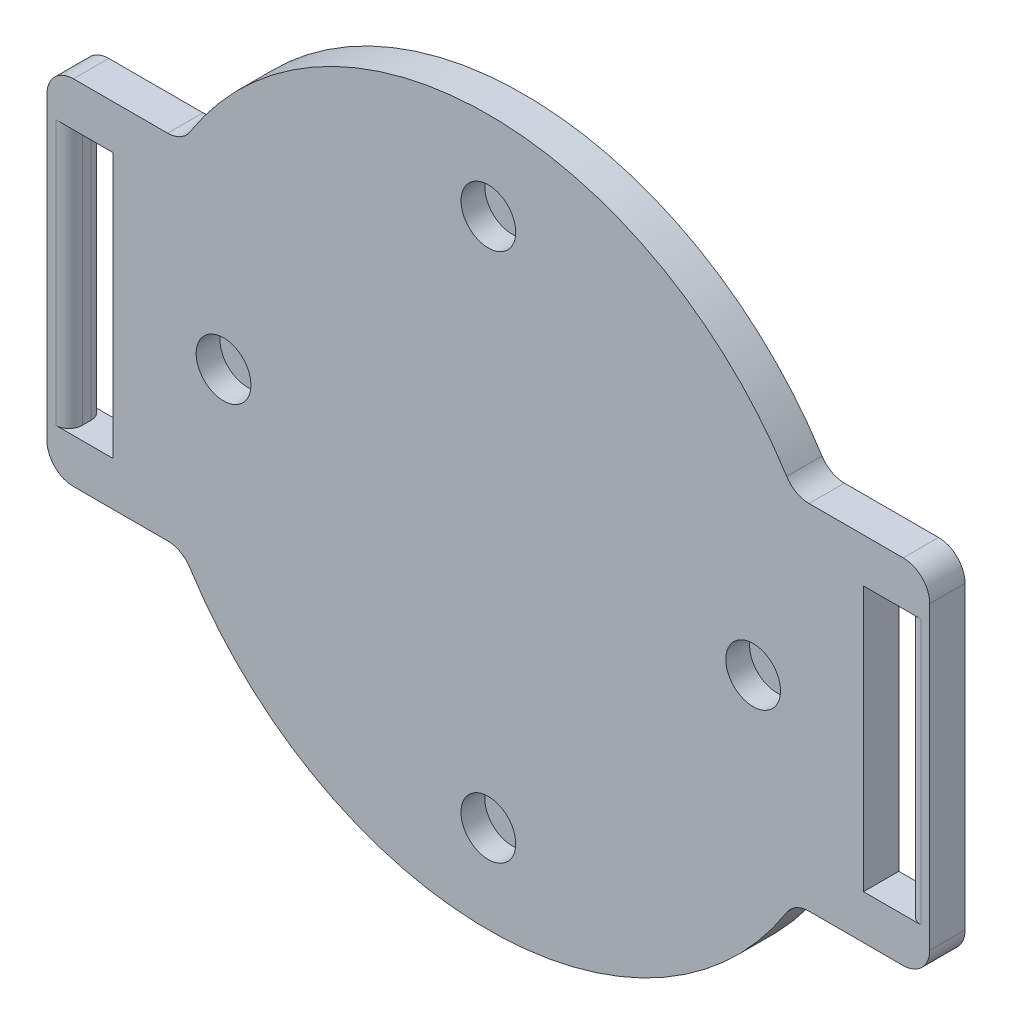
ISO-10303-21;
HEADER;
FILE_DESCRIPTION(('STEP AP214'),'2;1');
FILE_NAME('part.step','',(''),(''),'','','');
FILE_SCHEMA(('AUTOMOTIVE_DESIGN { 1 0 10303 214 1 1 1 1 }'));
ENDSEC;
DATA;
#1=APPLICATION_CONTEXT('core data for automotive mechanical design processes');
#2=APPLICATION_PROTOCOL_DEFINITION('international standard','automotive_design',2000,#1);
#3=PRODUCT_CONTEXT('',#1,'mechanical');
#4=PRODUCT('Part','Part','',(#3));
#5=PRODUCT_RELATED_PRODUCT_CATEGORY('part','',(#4));
#6=PRODUCT_DEFINITION_FORMATION('','',#4);
#7=PRODUCT_DEFINITION_CONTEXT('part definition',#1,'design');
#8=PRODUCT_DEFINITION('design','',#6,#7);
#9=PRODUCT_DEFINITION_SHAPE('','',#8);
#10=(LENGTH_UNIT() NAMED_UNIT(*) SI_UNIT(.MILLI.,.METRE.));
#11=(NAMED_UNIT(*) PLANE_ANGLE_UNIT() SI_UNIT($,.RADIAN.));
#12=(NAMED_UNIT(*) SI_UNIT($,.STERADIAN.) SOLID_ANGLE_UNIT());
#13=UNCERTAINTY_MEASURE_WITH_UNIT(LENGTH_MEASURE(1.E-05),#10,'distance_accuracy_value','');
#14=(GEOMETRIC_REPRESENTATION_CONTEXT(3) GLOBAL_UNCERTAINTY_ASSIGNED_CONTEXT((#13)) GLOBAL_UNIT_ASSIGNED_CONTEXT((#10,
#11,#12)) REPRESENTATION_CONTEXT('',''));
#15=CARTESIAN_POINT('',(0.,0.,0.));
#16=DIRECTION('',(0.,0.,1.));
#17=DIRECTION('',(1.,0.,0.));
#18=AXIS2_PLACEMENT_3D('',#15,#16,#17);
#19=CARTESIAN_POINT('',(0.,0.,4.));
#20=DIRECTION('',(0.,0.,-1.));
#21=DIRECTION('',(-1.,0.,0.));
#22=AXIS2_PLACEMENT_3D('',#19,#20,#21);
#23=CYLINDRICAL_SURFACE('',#22,40.);
#24=CARTESIAN_POINT('',(0.,0.,4.));
#25=DIRECTION('',(0.,0.,1.));
#26=DIRECTION('',(1.,0.,0.));
#27=AXIS2_PLACEMENT_3D('',#24,#25,#26);
#28=CIRCLE('',#27,40.);
#29=CARTESIAN_POINT('',(33.7970272085301,21.3953488372093,4.));
#30=VERTEX_POINT('',#29);
#31=CARTESIAN_POINT('',(-33.7970272085301,21.3953488372093,4.));
#32=VERTEX_POINT('',#31);
#33=EDGE_CURVE('E282',#30,#32,#28,.T.);
#34=ORIENTED_EDGE('',*,*,#33,.F.);
#35=DIRECTION('',(0.,0.,-1.));
#36=VECTOR('',#35,1.);
#37=CARTESIAN_POINT('',(33.7970272085301,21.3953488372093,4.));
#38=LINE('',#37,#36);
#39=CARTESIAN_POINT('',(33.7970272085301,21.3953488372093,0.));
#40=VERTEX_POINT('',#39);
#41=EDGE_CURVE('E440',#30,#40,#38,.T.);
#42=ORIENTED_EDGE('',*,*,#41,.T.);
#43=CARTESIAN_POINT('',(0.,0.,0.));
#44=DIRECTION('',(0.,0.,1.));
#45=DIRECTION('',(1.,0.,0.));
#46=AXIS2_PLACEMENT_3D('',#43,#44,#45);
#47=CIRCLE('',#46,40.);
#48=CARTESIAN_POINT('',(-33.7970272085301,21.3953488372093,0.));
#49=VERTEX_POINT('',#48);
#50=EDGE_CURVE('E305',#40,#49,#47,.T.);
#51=ORIENTED_EDGE('',*,*,#50,.T.);
#52=DIRECTION('',(0.,0.,-1.));
#53=VECTOR('',#52,1.);
#54=CARTESIAN_POINT('',(-33.7970272085301,21.3953488372093,4.));
#55=LINE('',#54,#53);
#56=EDGE_CURVE('E438',#49,#32,#55,.F.);
#57=ORIENTED_EDGE('',*,*,#56,.T.);
#58=EDGE_LOOP('',(#34,#42,#51,#57));
#59=FACE_BOUND('',#58,.T.);
#60=ADVANCED_FACE('F33',(#59),#23,.T.);
#61=CARTESIAN_POINT('',(-34.6410161513775,20.,4.));
#62=DIRECTION('',(0.,-1.,0.));
#63=DIRECTION('',(1.,0.,0.));
#64=AXIS2_PLACEMENT_3D('',#61,#62,#63);
#65=PLANE('',#64);
#66=DIRECTION('',(-1.,0.,0.));
#67=VECTOR('',#66,1.);
#68=CARTESIAN_POINT('',(-34.6410161513775,20.,4.));
#69=LINE('',#68,#67);
#70=CARTESIAN_POINT('',(-36.3318042491699,20.,4.));
#71=VERTEX_POINT('',#70);
#72=CARTESIAN_POINT('',(-47.,20.,4.));
#73=VERTEX_POINT('',#72);
#74=EDGE_CURVE('E284',#71,#73,#69,.T.);
#75=ORIENTED_EDGE('',*,*,#74,.F.);
#76=DIRECTION('',(0.,0.,1.));
#77=VECTOR('',#76,1.);
#78=CARTESIAN_POINT('',(-36.3318042491699,20.,0.));
#79=LINE('',#78,#77);
#80=CARTESIAN_POINT('',(-36.3318042491699,20.,0.));
#81=VERTEX_POINT('',#80);
#82=EDGE_CURVE('E445',#71,#81,#79,.F.);
#83=ORIENTED_EDGE('',*,*,#82,.T.);
#84=DIRECTION('',(-1.,0.,0.));
#85=VECTOR('',#84,1.);
#86=CARTESIAN_POINT('',(-34.6410161513775,20.,0.));
#87=LINE('',#86,#85);
#88=CARTESIAN_POINT('',(-47.,20.,0.));
#89=VERTEX_POINT('',#88);
#90=EDGE_CURVE('E308',#81,#89,#87,.T.);
#91=ORIENTED_EDGE('',*,*,#90,.T.);
#92=DIRECTION('',(0.,0.,-1.));
#93=VECTOR('',#92,1.);
#94=CARTESIAN_POINT('',(-47.,20.,4.));
#95=LINE('',#94,#93);
#96=EDGE_CURVE('E425',#89,#73,#95,.F.);
#97=ORIENTED_EDGE('',*,*,#96,.T.);
#98=EDGE_LOOP('',(#75,#83,#91,#97));
#99=FACE_BOUND('',#98,.T.);
#100=ADVANCED_FACE('F467',(#99),#65,.F.);
#101=CARTESIAN_POINT('',(-50.,-20.,4.));
#102=DIRECTION('',(1.,0.,0.));
#103=DIRECTION('',(0.,0.,-1.));
#104=AXIS2_PLACEMENT_3D('',#101,#102,#103);
#105=PLANE('',#104);
#106=DIRECTION('',(0.,-1.,0.));
#107=VECTOR('',#106,1.);
#108=CARTESIAN_POINT('',(-50.,-20.,0.));
#109=LINE('',#108,#107);
#110=CARTESIAN_POINT('',(-50.,17.,0.));
#111=VERTEX_POINT('',#110);
#112=CARTESIAN_POINT('',(-50.,-17.,0.));
#113=VERTEX_POINT('',#112);
#114=EDGE_CURVE('E311',#111,#113,#109,.T.);
#115=ORIENTED_EDGE('',*,*,#114,.T.);
#116=DIRECTION('',(0.,0.,-1.));
#117=VECTOR('',#116,1.);
#118=CARTESIAN_POINT('',(-50.,-17.,4.));
#119=LINE('',#118,#117);
#120=CARTESIAN_POINT('',(-50.,-17.,4.));
#121=VERTEX_POINT('',#120);
#122=EDGE_CURVE('E423',#113,#121,#119,.F.);
#123=ORIENTED_EDGE('',*,*,#122,.T.);
#124=DIRECTION('',(0.,-1.,0.));
#125=VECTOR('',#124,1.);
#126=CARTESIAN_POINT('',(-50.,-20.,4.));
#127=LINE('',#126,#125);
#128=CARTESIAN_POINT('',(-50.,17.,4.));
#129=VERTEX_POINT('',#128);
#130=EDGE_CURVE('E287',#129,#121,#127,.T.);
#131=ORIENTED_EDGE('',*,*,#130,.F.);
#132=DIRECTION('',(0.,0.,-1.));
#133=VECTOR('',#132,1.);
#134=CARTESIAN_POINT('',(-50.,17.,4.));
#135=LINE('',#134,#133);
#136=EDGE_CURVE('E420',#129,#111,#135,.T.);
#137=ORIENTED_EDGE('',*,*,#136,.T.);
#138=EDGE_LOOP('',(#115,#123,#131,#137));
#139=FACE_BOUND('',#138,.T.);
#140=ADVANCED_FACE('F475',(#139),#105,.F.);
#141=CARTESIAN_POINT('',(-34.6410161513775,-20.,4.));
#142=DIRECTION('',(0.,1.,0.));
#143=DIRECTION('',(-1.,0.,0.));
#144=AXIS2_PLACEMENT_3D('',#141,#142,#143);
#145=PLANE('',#144);
#146=DIRECTION('',(1.,0.,0.));
#147=VECTOR('',#146,1.);
#148=CARTESIAN_POINT('',(-34.6410161513775,-20.,0.));
#149=LINE('',#148,#147);
#150=CARTESIAN_POINT('',(-47.,-20.,0.));
#151=VERTEX_POINT('',#150);
#152=CARTESIAN_POINT('',(-36.3318042491699,-20.,0.));
#153=VERTEX_POINT('',#152);
#154=EDGE_CURVE('E314',#151,#153,#149,.T.);
#155=ORIENTED_EDGE('',*,*,#154,.T.);
#156=DIRECTION('',(0.,0.,1.));
#157=VECTOR('',#156,1.);
#158=CARTESIAN_POINT('',(-36.3318042491699,-20.,4.));
#159=LINE('',#158,#157);
#160=CARTESIAN_POINT('',(-36.3318042491699,-20.,4.));
#161=VERTEX_POINT('',#160);
#162=EDGE_CURVE('E433',#153,#161,#159,.T.);
#163=ORIENTED_EDGE('',*,*,#162,.T.);
#164=DIRECTION('',(1.,0.,0.));
#165=VECTOR('',#164,1.);
#166=CARTESIAN_POINT('',(-34.6410161513775,-20.,4.));
#167=LINE('',#166,#165);
#168=CARTESIAN_POINT('',(-47.,-20.,4.));
#169=VERTEX_POINT('',#168);
#170=EDGE_CURVE('E290',#169,#161,#167,.T.);
#171=ORIENTED_EDGE('',*,*,#170,.F.);
#172=DIRECTION('',(0.,0.,-1.));
#173=VECTOR('',#172,1.);
#174=CARTESIAN_POINT('',(-47.,-20.,4.));
#175=LINE('',#174,#173);
#176=EDGE_CURVE('E417',#169,#151,#175,.T.);
#177=ORIENTED_EDGE('',*,*,#176,.T.);
#178=EDGE_LOOP('',(#155,#163,#171,#177));
#179=FACE_BOUND('',#178,.T.);
#180=ADVANCED_FACE('F486',(#179),#145,.F.);
#181=CARTESIAN_POINT('',(0.,0.,4.));
#182=DIRECTION('',(0.,0.,-1.));
#183=DIRECTION('',(-1.,0.,0.));
#184=AXIS2_PLACEMENT_3D('',#181,#182,#183);
#185=CYLINDRICAL_SURFACE('',#184,40.);
#186=CARTESIAN_POINT('',(0.,0.,4.));
#187=DIRECTION('',(0.,0.,1.));
#188=DIRECTION('',(1.,0.,0.));
#189=AXIS2_PLACEMENT_3D('',#186,#187,#188);
#190=CIRCLE('',#189,40.);
#191=CARTESIAN_POINT('',(-33.7970272085301,-21.3953488372093,4.));
#192=VERTEX_POINT('',#191);
#193=CARTESIAN_POINT('',(33.7970272085301,-21.3953488372093,4.));
#194=VERTEX_POINT('',#193);
#195=EDGE_CURVE('E293',#192,#194,#190,.T.);
#196=ORIENTED_EDGE('',*,*,#195,.F.);
#197=DIRECTION('',(0.,0.,-1.));
#198=VECTOR('',#197,1.);
#199=CARTESIAN_POINT('',(-33.7970272085301,-21.3953488372093,4.));
#200=LINE('',#199,#198);
#201=CARTESIAN_POINT('',(-33.7970272085301,-21.3953488372093,0.));
#202=VERTEX_POINT('',#201);
#203=EDGE_CURVE('E430',#192,#202,#200,.T.);
#204=ORIENTED_EDGE('',*,*,#203,.T.);
#205=CARTESIAN_POINT('',(0.,0.,0.));
#206=DIRECTION('',(0.,0.,1.));
#207=DIRECTION('',(1.,0.,0.));
#208=AXIS2_PLACEMENT_3D('',#205,#206,#207);
#209=CIRCLE('',#208,40.);
#210=CARTESIAN_POINT('',(33.7970272085301,-21.3953488372093,0.));
#211=VERTEX_POINT('',#210);
#212=EDGE_CURVE('E317',#202,#211,#209,.T.);
#213=ORIENTED_EDGE('',*,*,#212,.T.);
#214=DIRECTION('',(0.,0.,-1.));
#215=VECTOR('',#214,1.);
#216=CARTESIAN_POINT('',(33.7970272085301,-21.3953488372093,4.));
#217=LINE('',#216,#215);
#218=EDGE_CURVE('E428',#211,#194,#217,.F.);
#219=ORIENTED_EDGE('',*,*,#218,.T.);
#220=EDGE_LOOP('',(#196,#204,#213,#219));
#221=FACE_BOUND('',#220,.T.);
#222=ADVANCED_FACE('F494',(#221),#185,.T.);
#223=CARTESIAN_POINT('',(50.,-20.,4.));
#224=DIRECTION('',(0.,1.,0.));
#225=DIRECTION('',(-1.,0.,0.));
#226=AXIS2_PLACEMENT_3D('',#223,#224,#225);
#227=PLANE('',#226);
#228=DIRECTION('',(1.,0.,0.));
#229=VECTOR('',#228,1.);
#230=CARTESIAN_POINT('',(50.,-20.,4.));
#231=LINE('',#230,#229);
#232=CARTESIAN_POINT('',(36.3318042491699,-20.,4.));
#233=VERTEX_POINT('',#232);
#234=CARTESIAN_POINT('',(47.,-20.,4.));
#235=VERTEX_POINT('',#234);
#236=EDGE_CURVE('E296',#233,#235,#231,.T.);
#237=ORIENTED_EDGE('',*,*,#236,.F.);
#238=DIRECTION('',(0.,0.,1.));
#239=VECTOR('',#238,1.);
#240=CARTESIAN_POINT('',(36.3318042491699,-20.,0.));
#241=LINE('',#240,#239);
#242=CARTESIAN_POINT('',(36.3318042491699,-20.,0.));
#243=VERTEX_POINT('',#242);
#244=EDGE_CURVE('E435',#233,#243,#241,.F.);
#245=ORIENTED_EDGE('',*,*,#244,.T.);
#246=DIRECTION('',(1.,0.,0.));
#247=VECTOR('',#246,1.);
#248=CARTESIAN_POINT('',(50.,-20.,0.));
#249=LINE('',#248,#247);
#250=CARTESIAN_POINT('',(47.,-20.,0.));
#251=VERTEX_POINT('',#250);
#252=EDGE_CURVE('E320',#243,#251,#249,.T.);
#253=ORIENTED_EDGE('',*,*,#252,.T.);
#254=DIRECTION('',(0.,0.,-1.));
#255=VECTOR('',#254,1.);
#256=CARTESIAN_POINT('',(47.,-20.,4.));
#257=LINE('',#256,#255);
#258=EDGE_CURVE('E414',#251,#235,#257,.F.);
#259=ORIENTED_EDGE('',*,*,#258,.T.);
#260=EDGE_LOOP('',(#237,#245,#253,#259));
#261=FACE_BOUND('',#260,.T.);
#262=ADVANCED_FACE('F502',(#261),#227,.F.);
#263=CARTESIAN_POINT('',(50.,-20.,4.));
#264=DIRECTION('',(-1.,0.,0.));
#265=DIRECTION('',(0.,0.,1.));
#266=AXIS2_PLACEMENT_3D('',#263,#264,#265);
#267=PLANE('',#266);
#268=DIRECTION('',(0.,1.,0.));
#269=VECTOR('',#268,1.);
#270=CARTESIAN_POINT('',(50.,-20.,0.));
#271=LINE('',#270,#269);
#272=CARTESIAN_POINT('',(50.,-17.,0.));
#273=VERTEX_POINT('',#272);
#274=CARTESIAN_POINT('',(50.,17.,0.));
#275=VERTEX_POINT('',#274);
#276=EDGE_CURVE('E322',#273,#275,#271,.T.);
#277=ORIENTED_EDGE('',*,*,#276,.T.);
#278=DIRECTION('',(0.,0.,-1.));
#279=VECTOR('',#278,1.);
#280=CARTESIAN_POINT('',(50.,17.,4.));
#281=LINE('',#280,#279);
#282=CARTESIAN_POINT('',(50.,17.,4.));
#283=VERTEX_POINT('',#282);
#284=EDGE_CURVE('E404',#275,#283,#281,.F.);
#285=ORIENTED_EDGE('',*,*,#284,.T.);
#286=DIRECTION('',(0.,1.,0.));
#287=VECTOR('',#286,1.);
#288=CARTESIAN_POINT('',(50.,-20.,4.));
#289=LINE('',#288,#287);
#290=CARTESIAN_POINT('',(50.,-17.,4.));
#291=VERTEX_POINT('',#290);
#292=EDGE_CURVE('E298',#291,#283,#289,.T.);
#293=ORIENTED_EDGE('',*,*,#292,.F.);
#294=DIRECTION('',(0.,0.,-1.));
#295=VECTOR('',#294,1.);
#296=CARTESIAN_POINT('',(50.,-17.,4.));
#297=LINE('',#296,#295);
#298=EDGE_CURVE('E401',#291,#273,#297,.T.);
#299=ORIENTED_EDGE('',*,*,#298,.T.);
#300=EDGE_LOOP('',(#277,#285,#293,#299));
#301=FACE_BOUND('',#300,.T.);
#302=ADVANCED_FACE('F512',(#301),#267,.F.);
#303=CARTESIAN_POINT('',(50.,20.,4.));
#304=DIRECTION('',(0.,-1.,0.));
#305=DIRECTION('',(1.,0.,0.));
#306=AXIS2_PLACEMENT_3D('',#303,#304,#305);
#307=PLANE('',#306);
#308=DIRECTION('',(-1.,0.,0.));
#309=VECTOR('',#308,1.);
#310=CARTESIAN_POINT('',(50.,20.,0.));
#311=LINE('',#310,#309);
#312=CARTESIAN_POINT('',(47.,20.,0.));
#313=VERTEX_POINT('',#312);
#314=CARTESIAN_POINT('',(36.3318042491699,20.,0.));
#315=VERTEX_POINT('',#314);
#316=EDGE_CURVE('E285',#313,#315,#311,.T.);
#317=ORIENTED_EDGE('',*,*,#316,.T.);
#318=DIRECTION('',(0.,0.,1.));
#319=VECTOR('',#318,1.);
#320=CARTESIAN_POINT('',(36.3318042491699,20.,4.));
#321=LINE('',#320,#319);
#322=CARTESIAN_POINT('',(36.3318042491699,20.,4.));
#323=VERTEX_POINT('',#322);
#324=EDGE_CURVE('E443',#315,#323,#321,.T.);
#325=ORIENTED_EDGE('',*,*,#324,.T.);
#326=DIRECTION('',(-1.,0.,0.));
#327=VECTOR('',#326,1.);
#328=CARTESIAN_POINT('',(50.,20.,4.));
#329=LINE('',#328,#327);
#330=CARTESIAN_POINT('',(47.,20.,4.));
#331=VERTEX_POINT('',#330);
#332=EDGE_CURVE('E301',#331,#323,#329,.T.);
#333=ORIENTED_EDGE('',*,*,#332,.F.);
#334=DIRECTION('',(0.,0.,-1.));
#335=VECTOR('',#334,1.);
#336=CARTESIAN_POINT('',(47.,20.,4.));
#337=LINE('',#336,#335);
#338=EDGE_CURVE('E388',#331,#313,#337,.T.);
#339=ORIENTED_EDGE('',*,*,#338,.T.);
#340=EDGE_LOOP('',(#317,#325,#333,#339));
#341=FACE_BOUND('',#340,.T.);
#342=ADVANCED_FACE('F521',(#341),#307,.F.);
#343=CARTESIAN_POINT('',(0.,0.,4.));
#344=DIRECTION('',(0.,0.,1.));
#345=DIRECTION('',(1.,0.,0.));
#346=AXIS2_PLACEMENT_3D('',#343,#344,#345);
#347=PLANE('',#346);
#348=DIRECTION('',(1.,0.,0.));
#349=VECTOR('',#348,1.);
#350=CARTESIAN_POINT('',(-47.5,-15.,4.));
#351=LINE('',#350,#349);
#352=CARTESIAN_POINT('',(-49.,-15.,4.));
#353=VERTEX_POINT('',#352);
#354=CARTESIAN_POINT('',(-42.5,-15.,4.));
#355=VERTEX_POINT('',#354);
#356=EDGE_CURVE('E231',#353,#355,#351,.T.);
#357=ORIENTED_EDGE('',*,*,#356,.F.);
#358=DIRECTION('',(0.,-1.,0.));
#359=VECTOR('',#358,1.);
#360=CARTESIAN_POINT('',(-49.,15.,4.));
#361=LINE('',#360,#359);
#362=CARTESIAN_POINT('',(-49.,15.,4.));
#363=VERTEX_POINT('',#362);
#364=EDGE_CURVE('E357',#353,#363,#361,.F.);
#365=ORIENTED_EDGE('',*,*,#364,.T.);
#366=DIRECTION('',(-1.,0.,0.));
#367=VECTOR('',#366,1.);
#368=CARTESIAN_POINT('',(-47.5,15.,4.));
#369=LINE('',#368,#367);
#370=CARTESIAN_POINT('',(-42.5,15.,4.));
#371=VERTEX_POINT('',#370);
#372=EDGE_CURVE('E239',#371,#363,#369,.T.);
#373=ORIENTED_EDGE('',*,*,#372,.F.);
#374=DIRECTION('',(0.,1.,0.));
#375=VECTOR('',#374,1.);
#376=CARTESIAN_POINT('',(-42.5,-15.,4.));
#377=LINE('',#376,#375);
#378=EDGE_CURVE('E221',#355,#371,#377,.T.);
#379=ORIENTED_EDGE('',*,*,#378,.F.);
#380=EDGE_LOOP('',(#357,#365,#373,#379));
#381=FACE_BOUND('',#380,.T.);
#382=DIRECTION('',(-1.,0.,0.));
#383=VECTOR('',#382,1.);
#384=CARTESIAN_POINT('',(47.5,15.,4.));
#385=LINE('',#384,#383);
#386=CARTESIAN_POINT('',(49.,15.,4.));
#387=VERTEX_POINT('',#386);
#388=CARTESIAN_POINT('',(42.5,15.,4.));
#389=VERTEX_POINT('',#388);
#390=EDGE_CURVE('E256',#387,#389,#385,.T.);
#391=ORIENTED_EDGE('',*,*,#390,.F.);
#392=DIRECTION('',(0.,1.,0.));
#393=VECTOR('',#392,1.);
#394=CARTESIAN_POINT('',(49.,-15.,4.));
#395=LINE('',#394,#393);
#396=CARTESIAN_POINT('',(49.,-15.,4.));
#397=VERTEX_POINT('',#396);
#398=EDGE_CURVE('E354',#387,#397,#395,.F.);
#399=ORIENTED_EDGE('',*,*,#398,.T.);
#400=DIRECTION('',(1.,0.,0.));
#401=VECTOR('',#400,1.);
#402=CARTESIAN_POINT('',(47.5,-15.,4.));
#403=LINE('',#402,#401);
#404=CARTESIAN_POINT('',(42.5,-15.,4.));
#405=VERTEX_POINT('',#404);
#406=EDGE_CURVE('E262',#405,#397,#403,.T.);
#407=ORIENTED_EDGE('',*,*,#406,.F.);
#408=DIRECTION('',(0.,-1.,0.));
#409=VECTOR('',#408,1.);
#410=CARTESIAN_POINT('',(42.5,-15.,4.));
#411=LINE('',#410,#409);
#412=EDGE_CURVE('E259',#389,#405,#411,.T.);
#413=ORIENTED_EDGE('',*,*,#412,.F.);
#414=EDGE_LOOP('',(#391,#399,#407,#413));
#415=FACE_BOUND('',#414,.T.);
#416=CARTESIAN_POINT('',(0.,30.,4.));
#417=DIRECTION('',(0.,0.,1.));
#418=DIRECTION('',(1.,0.,0.));
#419=AXIS2_PLACEMENT_3D('',#416,#417,#418);
#420=CIRCLE('',#419,3.1);
#421=CARTESIAN_POINT('',(3.1,30.,4.));
#422=VERTEX_POINT('',#421);
#423=EDGE_CURVE('E309',#422,#422,#420,.F.);
#424=ORIENTED_EDGE('',*,*,#423,.T.);
#425=EDGE_LOOP('',(#424));
#426=FACE_BOUND('',#425,.T.);
#427=CARTESIAN_POINT('',(30.,0.,4.));
#428=DIRECTION('',(0.,0.,1.));
#429=DIRECTION('',(1.,0.,0.));
#430=AXIS2_PLACEMENT_3D('',#427,#428,#429);
#431=CIRCLE('',#430,3.1);
#432=CARTESIAN_POINT('',(33.1,0.,4.));
#433=VERTEX_POINT('',#432);
#434=EDGE_CURVE('E332',#433,#433,#431,.F.);
#435=ORIENTED_EDGE('',*,*,#434,.T.);
#436=EDGE_LOOP('',(#435));
#437=FACE_BOUND('',#436,.T.);
#438=CARTESIAN_POINT('',(0.,-30.,4.));
#439=DIRECTION('',(0.,0.,1.));
#440=DIRECTION('',(1.,0.,0.));
#441=AXIS2_PLACEMENT_3D('',#438,#439,#440);
#442=CIRCLE('',#441,3.1);
#443=CARTESIAN_POINT('',(3.1,-30.,4.));
#444=VERTEX_POINT('',#443);
#445=EDGE_CURVE('E329',#444,#444,#442,.F.);
#446=ORIENTED_EDGE('',*,*,#445,.T.);
#447=EDGE_LOOP('',(#446));
#448=FACE_BOUND('',#447,.T.);
#449=CARTESIAN_POINT('',(-30.,0.,4.));
#450=DIRECTION('',(0.,0.,1.));
#451=DIRECTION('',(1.,0.,0.));
#452=AXIS2_PLACEMENT_3D('',#449,#450,#451);
#453=CIRCLE('',#452,3.1);
#454=CARTESIAN_POINT('',(-26.9,0.,4.));
#455=VERTEX_POINT('',#454);
#456=EDGE_CURVE('E273',#455,#455,#453,.F.);
#457=ORIENTED_EDGE('',*,*,#456,.T.);
#458=EDGE_LOOP('',(#457));
#459=FACE_BOUND('',#458,.T.);
#460=ORIENTED_EDGE('',*,*,#292,.T.);
#461=CARTESIAN_POINT('',(47.,17.,4.));
#462=DIRECTION('',(0.,0.,1.));
#463=DIRECTION('',(1.,0.,0.));
#464=AXIS2_PLACEMENT_3D('',#461,#462,#463);
#465=CIRCLE('',#464,3.);
#466=EDGE_CURVE('E412',#283,#331,#465,.T.);
#467=ORIENTED_EDGE('',*,*,#466,.T.);
#468=ORIENTED_EDGE('',*,*,#332,.T.);
#469=CARTESIAN_POINT('',(36.3318042491699,23.,4.));
#470=DIRECTION('',(0.,0.,1.));
#471=DIRECTION('',(1.,0.,0.));
#472=AXIS2_PLACEMENT_3D('',#469,#470,#471);
#473=CIRCLE('',#472,3.);
#474=EDGE_CURVE('E457',#323,#30,#473,.F.);
#475=ORIENTED_EDGE('',*,*,#474,.T.);
#476=ORIENTED_EDGE('',*,*,#33,.T.);
#477=CARTESIAN_POINT('',(-36.3318042491699,23.,4.));
#478=DIRECTION('',(0.,0.,1.));
#479=DIRECTION('',(1.,0.,0.));
#480=AXIS2_PLACEMENT_3D('',#477,#478,#479);
#481=CIRCLE('',#480,3.);
#482=EDGE_CURVE('E11',#32,#71,#481,.F.);
#483=ORIENTED_EDGE('',*,*,#482,.T.);
#484=ORIENTED_EDGE('',*,*,#74,.T.);
#485=CARTESIAN_POINT('',(-47.,17.,4.));
#486=DIRECTION('',(0.,0.,1.));
#487=DIRECTION('',(1.,0.,0.));
#488=AXIS2_PLACEMENT_3D('',#485,#486,#487);
#489=CIRCLE('',#488,3.);
#490=EDGE_CURVE('E406',#73,#129,#489,.T.);
#491=ORIENTED_EDGE('',*,*,#490,.T.);
#492=ORIENTED_EDGE('',*,*,#130,.T.);
#493=CARTESIAN_POINT('',(-47.,-17.,4.));
#494=DIRECTION('',(0.,0.,1.));
#495=DIRECTION('',(1.,0.,0.));
#496=AXIS2_PLACEMENT_3D('',#493,#494,#495);
#497=CIRCLE('',#496,3.);
#498=EDGE_CURVE('E408',#121,#169,#497,.T.);
#499=ORIENTED_EDGE('',*,*,#498,.T.);
#500=ORIENTED_EDGE('',*,*,#170,.T.);
#501=CARTESIAN_POINT('',(-36.3318042491699,-23.,4.));
#502=DIRECTION('',(0.,0.,1.));
#503=DIRECTION('',(1.,0.,0.));
#504=AXIS2_PLACEMENT_3D('',#501,#502,#503);
#505=CIRCLE('',#504,3.);
#506=EDGE_CURVE('E449',#161,#192,#505,.F.);
#507=ORIENTED_EDGE('',*,*,#506,.T.);
#508=ORIENTED_EDGE('',*,*,#195,.T.);
#509=CARTESIAN_POINT('',(36.3318042491699,-23.,4.));
#510=DIRECTION('',(0.,0.,1.));
#511=DIRECTION('',(1.,0.,0.));
#512=AXIS2_PLACEMENT_3D('',#509,#510,#511);
#513=CIRCLE('',#512,3.);
#514=EDGE_CURVE('E453',#194,#233,#513,.F.);
#515=ORIENTED_EDGE('',*,*,#514,.T.);
#516=ORIENTED_EDGE('',*,*,#236,.T.);
#517=CARTESIAN_POINT('',(47.,-17.,4.));
#518=DIRECTION('',(0.,0.,1.));
#519=DIRECTION('',(1.,0.,0.));
#520=AXIS2_PLACEMENT_3D('',#517,#518,#519);
#521=CIRCLE('',#520,3.);
#522=EDGE_CURVE('E410',#235,#291,#521,.T.);
#523=ORIENTED_EDGE('',*,*,#522,.T.);
#524=EDGE_LOOP('',(#460,#467,#468,#475,#476,#483,#484,#491,#492,#499,#500,#507,#508,#515,#516,#523));
#525=FACE_BOUND('',#524,.T.);
#526=ADVANCED_FACE('F242',(#381,#415,#426,#437,#448,#459,#525),#347,.T.);
#527=CARTESIAN_POINT('',(0.,0.,0.));
#528=DIRECTION('',(0.,0.,1.));
#529=DIRECTION('',(1.,0.,0.));
#530=AXIS2_PLACEMENT_3D('',#527,#528,#529);
#531=PLANE('',#530);
#532=DIRECTION('',(0.,-1.,0.));
#533=VECTOR('',#532,1.);
#534=CARTESIAN_POINT('',(-49.,0.,0.));
#535=LINE('',#534,#533);
#536=CARTESIAN_POINT('',(-49.,15.,0.));
#537=VERTEX_POINT('',#536);
#538=CARTESIAN_POINT('',(-49.,-15.,0.));
#539=VERTEX_POINT('',#538);
#540=EDGE_CURVE('E362',#537,#539,#535,.T.);
#541=ORIENTED_EDGE('',*,*,#540,.T.);
#542=DIRECTION('',(1.,0.,0.));
#543=VECTOR('',#542,1.);
#544=CARTESIAN_POINT('',(0.,-15.,0.));
#545=LINE('',#544,#543);
#546=CARTESIAN_POINT('',(-42.5,-15.,0.));
#547=VERTEX_POINT('',#546);
#548=EDGE_CURVE('E346',#539,#547,#545,.T.);
#549=ORIENTED_EDGE('',*,*,#548,.T.);
#550=DIRECTION('',(0.,1.,0.));
#551=VECTOR('',#550,1.);
#552=CARTESIAN_POINT('',(-42.5,0.,0.));
#553=LINE('',#552,#551);
#554=CARTESIAN_POINT('',(-42.5,15.,0.));
#555=VERTEX_POINT('',#554);
#556=EDGE_CURVE('E224',#547,#555,#553,.T.);
#557=ORIENTED_EDGE('',*,*,#556,.T.);
#558=DIRECTION('',(-1.,0.,0.));
#559=VECTOR('',#558,1.);
#560=CARTESIAN_POINT('',(0.,15.,0.));
#561=LINE('',#560,#559);
#562=EDGE_CURVE('E344',#555,#537,#561,.T.);
#563=ORIENTED_EDGE('',*,*,#562,.T.);
#564=EDGE_LOOP('',(#541,#549,#557,#563));
#565=FACE_BOUND('',#564,.T.);
#566=DIRECTION('',(0.,1.,0.));
#567=VECTOR('',#566,1.);
#568=CARTESIAN_POINT('',(49.,0.,0.));
#569=LINE('',#568,#567);
#570=CARTESIAN_POINT('',(49.,-15.,0.));
#571=VERTEX_POINT('',#570);
#572=CARTESIAN_POINT('',(49.,15.,0.));
#573=VERTEX_POINT('',#572);
#574=EDGE_CURVE('E359',#571,#573,#569,.T.);
#575=ORIENTED_EDGE('',*,*,#574,.T.);
#576=DIRECTION('',(-1.,0.,0.));
#577=VECTOR('',#576,1.);
#578=CARTESIAN_POINT('',(0.,15.,0.));
#579=LINE('',#578,#577);
#580=CARTESIAN_POINT('',(42.5,15.,0.));
#581=VERTEX_POINT('',#580);
#582=EDGE_CURVE('E304',#573,#581,#579,.T.);
#583=ORIENTED_EDGE('',*,*,#582,.T.);
#584=DIRECTION('',(0.,-1.,0.));
#585=VECTOR('',#584,1.);
#586=CARTESIAN_POINT('',(42.5,0.,0.));
#587=LINE('',#586,#585);
#588=CARTESIAN_POINT('',(42.5,-15.,0.));
#589=VERTEX_POINT('',#588);
#590=EDGE_CURVE('E339',#581,#589,#587,.T.);
#591=ORIENTED_EDGE('',*,*,#590,.T.);
#592=DIRECTION('',(1.,0.,0.));
#593=VECTOR('',#592,1.);
#594=CARTESIAN_POINT('',(0.,-15.,0.));
#595=LINE('',#594,#593);
#596=EDGE_CURVE('E342',#589,#571,#595,.T.);
#597=ORIENTED_EDGE('',*,*,#596,.T.);
#598=EDGE_LOOP('',(#575,#583,#591,#597));
#599=FACE_BOUND('',#598,.T.);
#600=ORIENTED_EDGE('',*,*,#316,.F.);
#601=CARTESIAN_POINT('',(47.,17.,0.));
#602=DIRECTION('',(0.,0.,1.));
#603=DIRECTION('',(1.,0.,0.));
#604=AXIS2_PLACEMENT_3D('',#601,#602,#603);
#605=CIRCLE('',#604,3.);
#606=EDGE_CURVE('E399',#313,#275,#605,.F.);
#607=ORIENTED_EDGE('',*,*,#606,.T.);
#608=ORIENTED_EDGE('',*,*,#276,.F.);
#609=CARTESIAN_POINT('',(47.,-17.,0.));
#610=DIRECTION('',(0.,0.,1.));
#611=DIRECTION('',(1.,0.,0.));
#612=AXIS2_PLACEMENT_3D('',#609,#610,#611);
#613=CIRCLE('',#612,3.);
#614=EDGE_CURVE('E396',#273,#251,#613,.F.);
#615=ORIENTED_EDGE('',*,*,#614,.T.);
#616=ORIENTED_EDGE('',*,*,#252,.F.);
#617=CARTESIAN_POINT('',(36.3318042491699,-23.,0.));
#618=DIRECTION('',(0.,0.,1.));
#619=DIRECTION('',(1.,0.,0.));
#620=AXIS2_PLACEMENT_3D('',#617,#618,#619);
#621=CIRCLE('',#620,3.);
#622=EDGE_CURVE('E451',#243,#211,#621,.T.);
#623=ORIENTED_EDGE('',*,*,#622,.T.);
#624=ORIENTED_EDGE('',*,*,#212,.F.);
#625=CARTESIAN_POINT('',(-36.3318042491699,-23.,0.));
#626=DIRECTION('',(0.,0.,1.));
#627=DIRECTION('',(1.,0.,0.));
#628=AXIS2_PLACEMENT_3D('',#625,#626,#627);
#629=CIRCLE('',#628,3.);
#630=EDGE_CURVE('E447',#202,#153,#629,.T.);
#631=ORIENTED_EDGE('',*,*,#630,.T.);
#632=ORIENTED_EDGE('',*,*,#154,.F.);
#633=CARTESIAN_POINT('',(-47.,-17.,0.));
#634=DIRECTION('',(0.,0.,1.));
#635=DIRECTION('',(1.,0.,0.));
#636=AXIS2_PLACEMENT_3D('',#633,#634,#635);
#637=CIRCLE('',#636,3.);
#638=EDGE_CURVE('E394',#151,#113,#637,.F.);
#639=ORIENTED_EDGE('',*,*,#638,.T.);
#640=ORIENTED_EDGE('',*,*,#114,.F.);
#641=CARTESIAN_POINT('',(-47.,17.,0.));
#642=DIRECTION('',(0.,0.,1.));
#643=DIRECTION('',(1.,0.,0.));
#644=AXIS2_PLACEMENT_3D('',#641,#642,#643);
#645=CIRCLE('',#644,3.);
#646=EDGE_CURVE('E391',#111,#89,#645,.F.);
#647=ORIENTED_EDGE('',*,*,#646,.T.);
#648=ORIENTED_EDGE('',*,*,#90,.F.);
#649=CARTESIAN_POINT('',(-36.3318042491699,23.,0.));
#650=DIRECTION('',(0.,0.,1.));
#651=DIRECTION('',(1.,0.,0.));
#652=AXIS2_PLACEMENT_3D('',#649,#650,#651);
#653=CIRCLE('',#652,3.);
#654=EDGE_CURVE('E41',#81,#49,#653,.T.);
#655=ORIENTED_EDGE('',*,*,#654,.T.);
#656=ORIENTED_EDGE('',*,*,#50,.F.);
#657=CARTESIAN_POINT('',(36.3318042491699,23.,0.));
#658=DIRECTION('',(0.,0.,1.));
#659=DIRECTION('',(1.,0.,0.));
#660=AXIS2_PLACEMENT_3D('',#657,#658,#659);
#661=CIRCLE('',#660,3.);
#662=EDGE_CURVE('E455',#40,#315,#661,.T.);
#663=ORIENTED_EDGE('',*,*,#662,.T.);
#664=EDGE_LOOP('',(#600,#607,#608,#615,#616,#623,#624,#631,#632,#639,#640,#647,#648,#655,#656,#663));
#665=FACE_BOUND('',#664,.T.);
#666=ADVANCED_FACE('F462',(#565,#599,#665),#531,.F.);
#667=CARTESIAN_POINT('',(-30.,0.,4.000012));
#668=DIRECTION('',(0.,0.,-1.));
#669=DIRECTION('',(-1.,0.,0.));
#670=AXIS2_PLACEMENT_3D('',#667,#668,#669);
#671=CYLINDRICAL_SURFACE('',#670,3.1);
#672=ORIENTED_EDGE('',*,*,#456,.F.);
#673=EDGE_LOOP('',(#672));
#674=FACE_BOUND('',#673,.T.);
#675=CARTESIAN_POINT('',(-30.,0.,1.3));
#676=DIRECTION('',(0.,0.,1.));
#677=DIRECTION('',(1.,0.,0.));
#678=AXIS2_PLACEMENT_3D('',#675,#676,#677);
#679=CIRCLE('',#678,3.1);
#680=CARTESIAN_POINT('',(-26.9,0.,1.3));
#681=VERTEX_POINT('',#680);
#682=EDGE_CURVE('E227',#681,#681,#679,.T.);
#683=ORIENTED_EDGE('',*,*,#682,.F.);
#684=EDGE_LOOP('',(#683));
#685=FACE_BOUND('',#684,.T.);
#686=ADVANCED_FACE('F759',(#674,#685),#671,.F.);
#687=CARTESIAN_POINT('',(-30.,0.,1.3));
#688=DIRECTION('',(0.,0.,1.));
#689=DIRECTION('',(1.,0.,0.));
#690=AXIS2_PLACEMENT_3D('',#687,#688,#689);
#691=PLANE('',#690);
#692=ORIENTED_EDGE('',*,*,#682,.T.);
#693=EDGE_LOOP('',(#692));
#694=FACE_BOUND('',#693,.T.);
#695=ADVANCED_FACE('F750',(#694),#691,.T.);
#696=CARTESIAN_POINT('',(0.,-30.,4.000012));
#697=DIRECTION('',(0.,0.,-1.));
#698=DIRECTION('',(-1.,0.,0.));
#699=AXIS2_PLACEMENT_3D('',#696,#697,#698);
#700=CYLINDRICAL_SURFACE('',#699,3.1);
#701=ORIENTED_EDGE('',*,*,#445,.F.);
#702=EDGE_LOOP('',(#701));
#703=FACE_BOUND('',#702,.T.);
#704=CARTESIAN_POINT('',(0.,-30.,1.3));
#705=DIRECTION('',(0.,0.,1.));
#706=DIRECTION('',(1.,0.,0.));
#707=AXIS2_PLACEMENT_3D('',#704,#705,#706);
#708=CIRCLE('',#707,3.1);
#709=CARTESIAN_POINT('',(3.1,-30.,1.3));
#710=VERTEX_POINT('',#709);
#711=EDGE_CURVE('E277',#710,#710,#708,.T.);
#712=ORIENTED_EDGE('',*,*,#711,.F.);
#713=EDGE_LOOP('',(#712));
#714=FACE_BOUND('',#713,.T.);
#715=ADVANCED_FACE('F741',(#703,#714),#700,.F.);
#716=CARTESIAN_POINT('',(0.,-30.,1.3));
#717=DIRECTION('',(0.,0.,1.));
#718=DIRECTION('',(1.,0.,0.));
#719=AXIS2_PLACEMENT_3D('',#716,#717,#718);
#720=PLANE('',#719);
#721=ORIENTED_EDGE('',*,*,#711,.T.);
#722=EDGE_LOOP('',(#721));
#723=FACE_BOUND('',#722,.T.);
#724=ADVANCED_FACE('F732',(#723),#720,.T.);
#725=CARTESIAN_POINT('',(30.,0.,4.000012));
#726=DIRECTION('',(0.,0.,-1.));
#727=DIRECTION('',(-1.,0.,0.));
#728=AXIS2_PLACEMENT_3D('',#725,#726,#727);
#729=CYLINDRICAL_SURFACE('',#728,3.1);
#730=ORIENTED_EDGE('',*,*,#434,.F.);
#731=EDGE_LOOP('',(#730));
#732=FACE_BOUND('',#731,.T.);
#733=CARTESIAN_POINT('',(30.,0.,1.3));
#734=DIRECTION('',(0.,0.,1.));
#735=DIRECTION('',(1.,0.,0.));
#736=AXIS2_PLACEMENT_3D('',#733,#734,#735);
#737=CIRCLE('',#736,3.1);
#738=CARTESIAN_POINT('',(33.1,0.,1.3));
#739=VERTEX_POINT('',#738);
#740=EDGE_CURVE('E274',#739,#739,#737,.T.);
#741=ORIENTED_EDGE('',*,*,#740,.F.);
#742=EDGE_LOOP('',(#741));
#743=FACE_BOUND('',#742,.T.);
#744=ADVANCED_FACE('F723',(#732,#743),#729,.F.);
#745=CARTESIAN_POINT('',(30.,0.,1.3));
#746=DIRECTION('',(0.,0.,1.));
#747=DIRECTION('',(1.,0.,0.));
#748=AXIS2_PLACEMENT_3D('',#745,#746,#747);
#749=PLANE('',#748);
#750=ORIENTED_EDGE('',*,*,#740,.T.);
#751=EDGE_LOOP('',(#750));
#752=FACE_BOUND('',#751,.T.);
#753=ADVANCED_FACE('F714',(#752),#749,.T.);
#754=CARTESIAN_POINT('',(0.,30.,4.000012));
#755=DIRECTION('',(0.,0.,-1.));
#756=DIRECTION('',(-1.,0.,0.));
#757=AXIS2_PLACEMENT_3D('',#754,#755,#756);
#758=CYLINDRICAL_SURFACE('',#757,3.1);
#759=ORIENTED_EDGE('',*,*,#423,.F.);
#760=EDGE_LOOP('',(#759));
#761=FACE_BOUND('',#760,.T.);
#762=CARTESIAN_POINT('',(0.,30.,1.3));
#763=DIRECTION('',(0.,0.,1.));
#764=DIRECTION('',(1.,0.,0.));
#765=AXIS2_PLACEMENT_3D('',#762,#763,#764);
#766=CIRCLE('',#765,3.1);
#767=CARTESIAN_POINT('',(3.1,30.,1.3));
#768=VERTEX_POINT('',#767);
#769=EDGE_CURVE('E270',#768,#768,#766,.T.);
#770=ORIENTED_EDGE('',*,*,#769,.F.);
#771=EDGE_LOOP('',(#770));
#772=FACE_BOUND('',#771,.T.);
#773=ADVANCED_FACE('F705',(#761,#772),#758,.F.);
#774=CARTESIAN_POINT('',(0.,30.,1.3));
#775=DIRECTION('',(0.,0.,1.));
#776=DIRECTION('',(1.,0.,0.));
#777=AXIS2_PLACEMENT_3D('',#774,#775,#776);
#778=PLANE('',#777);
#779=ORIENTED_EDGE('',*,*,#769,.T.);
#780=EDGE_LOOP('',(#779));
#781=FACE_BOUND('',#780,.T.);
#782=ADVANCED_FACE('F697',(#781),#778,.T.);
#783=CARTESIAN_POINT('',(47.5,-15.,-8.7));
#784=DIRECTION('',(1.,0.,0.));
#785=DIRECTION('',(0.,0.,-1.));
#786=AXIS2_PLACEMENT_3D('',#783,#784,#785);
#787=PLANE('',#786);
#788=DIRECTION('',(0.,0.,1.));
#789=VECTOR('',#788,1.);
#790=CARTESIAN_POINT('',(47.5,15.,-8.7));
#791=LINE('',#790,#789);
#792=CARTESIAN_POINT('',(47.5,15.,1.5));
#793=VERTEX_POINT('',#792);
#794=CARTESIAN_POINT('',(47.5,15.,2.5));
#795=VERTEX_POINT('',#794);
#796=EDGE_CURVE('E263',#793,#795,#791,.T.);
#797=ORIENTED_EDGE('',*,*,#796,.F.);
#798=DIRECTION('',(0.,1.,0.));
#799=VECTOR('',#798,1.);
#800=CARTESIAN_POINT('',(47.5,-15.,1.5));
#801=LINE('',#800,#799);
#802=CARTESIAN_POINT('',(47.5,-15.,1.5));
#803=VERTEX_POINT('',#802);
#804=EDGE_CURVE('E368',#793,#803,#801,.F.);
#805=ORIENTED_EDGE('',*,*,#804,.T.);
#806=DIRECTION('',(0.,0.,1.));
#807=VECTOR('',#806,1.);
#808=CARTESIAN_POINT('',(47.5,-15.,-8.7));
#809=LINE('',#808,#807);
#810=CARTESIAN_POINT('',(47.5,-15.,2.5));
#811=VERTEX_POINT('',#810);
#812=EDGE_CURVE('E244',#803,#811,#809,.T.);
#813=ORIENTED_EDGE('',*,*,#812,.T.);
#814=DIRECTION('',(0.,1.,0.));
#815=VECTOR('',#814,1.);
#816=CARTESIAN_POINT('',(47.5,15.,2.5));
#817=LINE('',#816,#815);
#818=EDGE_CURVE('E365',#811,#795,#817,.T.);
#819=ORIENTED_EDGE('',*,*,#818,.T.);
#820=EDGE_LOOP('',(#797,#805,#813,#819));
#821=FACE_BOUND('',#820,.T.);
#822=ADVANCED_FACE('F689',(#821),#787,.F.);
#823=CARTESIAN_POINT('',(47.5,-15.,-8.7));
#824=DIRECTION('',(0.,-1.,0.));
#825=DIRECTION('',(0.,0.,-1.));
#826=AXIS2_PLACEMENT_3D('',#823,#824,#825);
#827=PLANE('',#826);
#828=DIRECTION('',(0.,0.,1.));
#829=VECTOR('',#828,1.);
#830=CARTESIAN_POINT('',(42.5,-15.,-8.7));
#831=LINE('',#830,#829);
#832=EDGE_CURVE('E248',#589,#405,#831,.T.);
#833=ORIENTED_EDGE('',*,*,#832,.T.);
#834=ORIENTED_EDGE('',*,*,#406,.T.);
#835=CARTESIAN_POINT('',(49.,-15.,2.5));
#836=DIRECTION('',(0.,-1.,0.));
#837=DIRECTION('',(0.,0.,-1.));
#838=AXIS2_PLACEMENT_3D('',#835,#836,#837);
#839=CIRCLE('',#838,1.5);
#840=EDGE_CURVE('E386',#397,#811,#839,.T.);
#841=ORIENTED_EDGE('',*,*,#840,.T.);
#842=ORIENTED_EDGE('',*,*,#812,.F.);
#843=CARTESIAN_POINT('',(49.,-15.,1.5));
#844=DIRECTION('',(0.,-1.,0.));
#845=DIRECTION('',(0.,0.,-1.));
#846=AXIS2_PLACEMENT_3D('',#843,#844,#845);
#847=CIRCLE('',#846,1.5);
#848=EDGE_CURVE('E380',#803,#571,#847,.T.);
#849=ORIENTED_EDGE('',*,*,#848,.T.);
#850=ORIENTED_EDGE('',*,*,#596,.F.);
#851=EDGE_LOOP('',(#833,#834,#841,#842,#849,#850));
#852=FACE_BOUND('',#851,.T.);
#853=ADVANCED_FACE('F680',(#852),#827,.F.);
#854=CARTESIAN_POINT('',(42.5,-15.,-8.7));
#855=DIRECTION('',(-1.,0.,0.));
#856=DIRECTION('',(0.,0.,1.));
#857=AXIS2_PLACEMENT_3D('',#854,#855,#856);
#858=PLANE('',#857);
#859=DIRECTION('',(0.,0.,1.));
#860=VECTOR('',#859,1.);
#861=CARTESIAN_POINT('',(42.5,15.,-8.7));
#862=LINE('',#861,#860);
#863=EDGE_CURVE('E266',#581,#389,#862,.T.);
#864=ORIENTED_EDGE('',*,*,#863,.T.);
#865=ORIENTED_EDGE('',*,*,#412,.T.);
#866=ORIENTED_EDGE('',*,*,#832,.F.);
#867=ORIENTED_EDGE('',*,*,#590,.F.);
#868=EDGE_LOOP('',(#864,#865,#866,#867));
#869=FACE_BOUND('',#868,.T.);
#870=ADVANCED_FACE('F671',(#869),#858,.F.);
#871=CARTESIAN_POINT('',(47.5,15.,-8.7));
#872=DIRECTION('',(0.,1.,0.));
#873=DIRECTION('',(0.,0.,1.));
#874=AXIS2_PLACEMENT_3D('',#871,#872,#873);
#875=PLANE('',#874);
#876=ORIENTED_EDGE('',*,*,#582,.F.);
#877=CARTESIAN_POINT('',(49.,15.,1.5));
#878=DIRECTION('',(0.,1.,0.));
#879=DIRECTION('',(0.,0.,1.));
#880=AXIS2_PLACEMENT_3D('',#877,#878,#879);
#881=CIRCLE('',#880,1.5);
#882=EDGE_CURVE('E378',#573,#793,#881,.T.);
#883=ORIENTED_EDGE('',*,*,#882,.T.);
#884=ORIENTED_EDGE('',*,*,#796,.T.);
#885=CARTESIAN_POINT('',(49.,15.,2.5));
#886=DIRECTION('',(0.,1.,0.));
#887=DIRECTION('',(0.,0.,1.));
#888=AXIS2_PLACEMENT_3D('',#885,#886,#887);
#889=CIRCLE('',#888,1.5);
#890=EDGE_CURVE('E383',#795,#387,#889,.T.);
#891=ORIENTED_EDGE('',*,*,#890,.T.);
#892=ORIENTED_EDGE('',*,*,#390,.T.);
#893=ORIENTED_EDGE('',*,*,#863,.F.);
#894=EDGE_LOOP('',(#876,#883,#884,#891,#892,#893));
#895=FACE_BOUND('',#894,.T.);
#896=ADVANCED_FACE('F662',(#895),#875,.F.);
#897=CARTESIAN_POINT('',(-42.5,-15.,-8.7));
#898=DIRECTION('',(1.,0.,0.));
#899=DIRECTION('',(0.,0.,-1.));
#900=AXIS2_PLACEMENT_3D('',#897,#898,#899);
#901=PLANE('',#900);
#902=DIRECTION('',(0.,0.,1.));
#903=VECTOR('',#902,1.);
#904=CARTESIAN_POINT('',(-42.5,-15.,-8.7));
#905=LINE('',#904,#903);
#906=EDGE_CURVE('E216',#547,#355,#905,.T.);
#907=ORIENTED_EDGE('',*,*,#906,.T.);
#908=ORIENTED_EDGE('',*,*,#378,.T.);
#909=DIRECTION('',(0.,0.,1.));
#910=VECTOR('',#909,1.);
#911=CARTESIAN_POINT('',(-42.5,15.,-8.7));
#912=LINE('',#911,#910);
#913=EDGE_CURVE('E238',#555,#371,#912,.T.);
#914=ORIENTED_EDGE('',*,*,#913,.F.);
#915=ORIENTED_EDGE('',*,*,#556,.F.);
#916=EDGE_LOOP('',(#907,#908,#914,#915));
#917=FACE_BOUND('',#916,.T.);
#918=ADVANCED_FACE('F218',(#917),#901,.F.);
#919=CARTESIAN_POINT('',(-47.5,-15.,-8.7));
#920=DIRECTION('',(0.,-1.,0.));
#921=DIRECTION('',(0.,0.,-1.));
#922=AXIS2_PLACEMENT_3D('',#919,#920,#921);
#923=PLANE('',#922);
#924=ORIENTED_EDGE('',*,*,#548,.F.);
#925=CARTESIAN_POINT('',(-49.,-15.,1.5));
#926=DIRECTION('',(0.,-1.,0.));
#927=DIRECTION('',(0.,0.,-1.));
#928=AXIS2_PLACEMENT_3D('',#925,#926,#927);
#929=CIRCLE('',#928,1.5);
#930=CARTESIAN_POINT('',(-47.5,-15.,1.5));
#931=VERTEX_POINT('',#930);
#932=EDGE_CURVE('E373',#539,#931,#929,.T.);
#933=ORIENTED_EDGE('',*,*,#932,.T.);
#934=DIRECTION('',(0.,0.,1.));
#935=VECTOR('',#934,1.);
#936=CARTESIAN_POINT('',(-47.5,-15.,-8.7));
#937=LINE('',#936,#935);
#938=CARTESIAN_POINT('',(-47.5,-15.,2.5));
#939=VERTEX_POINT('',#938);
#940=EDGE_CURVE('E228',#931,#939,#937,.T.);
#941=ORIENTED_EDGE('',*,*,#940,.T.);
#942=CARTESIAN_POINT('',(-49.,-15.,2.5));
#943=DIRECTION('',(0.,-1.,0.));
#944=DIRECTION('',(0.,0.,-1.));
#945=AXIS2_PLACEMENT_3D('',#942,#943,#944);
#946=CIRCLE('',#945,1.5);
#947=EDGE_CURVE('E234',#939,#353,#946,.T.);
#948=ORIENTED_EDGE('',*,*,#947,.T.);
#949=ORIENTED_EDGE('',*,*,#356,.T.);
#950=ORIENTED_EDGE('',*,*,#906,.F.);
#951=EDGE_LOOP('',(#924,#933,#941,#948,#949,#950));
#952=FACE_BOUND('',#951,.T.);
#953=ADVANCED_FACE('F232',(#952),#923,.F.);
#954=CARTESIAN_POINT('',(-47.5,-15.,-8.7));
#955=DIRECTION('',(-1.,0.,0.));
#956=DIRECTION('',(0.,0.,1.));
#957=AXIS2_PLACEMENT_3D('',#954,#955,#956);
#958=PLANE('',#957);
#959=DIRECTION('',(0.,0.,1.));
#960=VECTOR('',#959,1.);
#961=CARTESIAN_POINT('',(-47.5,15.,-8.7));
#962=LINE('',#961,#960);
#963=CARTESIAN_POINT('',(-47.5,15.,1.5));
#964=VERTEX_POINT('',#963);
#965=CARTESIAN_POINT('',(-47.5,15.,2.5));
#966=VERTEX_POINT('',#965);
#967=EDGE_CURVE('E252',#964,#966,#962,.T.);
#968=ORIENTED_EDGE('',*,*,#967,.T.);
#969=DIRECTION('',(0.,-1.,0.));
#970=VECTOR('',#969,1.);
#971=CARTESIAN_POINT('',(-47.5,-15.,2.5));
#972=LINE('',#971,#970);
#973=EDGE_CURVE('E351',#966,#939,#972,.T.);
#974=ORIENTED_EDGE('',*,*,#973,.T.);
#975=ORIENTED_EDGE('',*,*,#940,.F.);
#976=DIRECTION('',(0.,-1.,0.));
#977=VECTOR('',#976,1.);
#978=CARTESIAN_POINT('',(-47.5,-15.,1.5));
#979=LINE('',#978,#977);
#980=EDGE_CURVE('E349',#931,#964,#979,.F.);
#981=ORIENTED_EDGE('',*,*,#980,.T.);
#982=EDGE_LOOP('',(#968,#974,#975,#981));
#983=FACE_BOUND('',#982,.T.);
#984=ADVANCED_FACE('F637',(#983),#958,.F.);
#985=CARTESIAN_POINT('',(-47.5,15.,-8.7));
#986=DIRECTION('',(0.,1.,0.));
#987=DIRECTION('',(0.,0.,1.));
#988=AXIS2_PLACEMENT_3D('',#985,#986,#987);
#989=PLANE('',#988);
#990=ORIENTED_EDGE('',*,*,#913,.T.);
#991=ORIENTED_EDGE('',*,*,#372,.T.);
#992=CARTESIAN_POINT('',(-49.,15.,2.5));
#993=DIRECTION('',(0.,1.,0.));
#994=DIRECTION('',(0.,0.,1.));
#995=AXIS2_PLACEMENT_3D('',#992,#993,#994);
#996=CIRCLE('',#995,1.5);
#997=EDGE_CURVE('E371',#363,#966,#996,.T.);
#998=ORIENTED_EDGE('',*,*,#997,.T.);
#999=ORIENTED_EDGE('',*,*,#967,.F.);
#1000=CARTESIAN_POINT('',(-49.,15.,1.5));
#1001=DIRECTION('',(0.,1.,0.));
#1002=DIRECTION('',(0.,0.,1.));
#1003=AXIS2_PLACEMENT_3D('',#1000,#1001,#1002);
#1004=CIRCLE('',#1003,1.5);
#1005=EDGE_CURVE('E375',#964,#537,#1004,.T.);
#1006=ORIENTED_EDGE('',*,*,#1005,.T.);
#1007=ORIENTED_EDGE('',*,*,#562,.F.);
#1008=EDGE_LOOP('',(#990,#991,#998,#999,#1006,#1007));
#1009=FACE_BOUND('',#1008,.T.);
#1010=ADVANCED_FACE('F544',(#1009),#989,.F.);
#1011=CARTESIAN_POINT('',(-49.,-15.,2.5));
#1012=DIRECTION('',(0.,1.,0.));
#1013=DIRECTION('',(0.,0.,1.));
#1014=AXIS2_PLACEMENT_3D('',#1011,#1012,#1013);
#1015=CYLINDRICAL_SURFACE('',#1014,1.5);
#1016=ORIENTED_EDGE('',*,*,#997,.F.);
#1017=ORIENTED_EDGE('',*,*,#364,.F.);
#1018=ORIENTED_EDGE('',*,*,#947,.F.);
#1019=ORIENTED_EDGE('',*,*,#973,.F.);
#1020=EDGE_LOOP('',(#1016,#1017,#1018,#1019));
#1021=FACE_BOUND('',#1020,.T.);
#1022=ADVANCED_FACE('F540',(#1021),#1015,.T.);
#1023=CARTESIAN_POINT('',(-49.,0.,1.5));
#1024=DIRECTION('',(0.,-1.,0.));
#1025=DIRECTION('',(0.,0.,-1.));
#1026=AXIS2_PLACEMENT_3D('',#1023,#1024,#1025);
#1027=CYLINDRICAL_SURFACE('',#1026,1.5);
#1028=ORIENTED_EDGE('',*,*,#1005,.F.);
#1029=ORIENTED_EDGE('',*,*,#980,.F.);
#1030=ORIENTED_EDGE('',*,*,#932,.F.);
#1031=ORIENTED_EDGE('',*,*,#540,.F.);
#1032=EDGE_LOOP('',(#1028,#1029,#1030,#1031));
#1033=FACE_BOUND('',#1032,.T.);
#1034=ADVANCED_FACE('F543',(#1033),#1027,.T.);
#1035=CARTESIAN_POINT('',(49.,0.,1.5));
#1036=DIRECTION('',(0.,1.,0.));
#1037=DIRECTION('',(0.,0.,1.));
#1038=AXIS2_PLACEMENT_3D('',#1035,#1036,#1037);
#1039=CYLINDRICAL_SURFACE('',#1038,1.5);
#1040=ORIENTED_EDGE('',*,*,#848,.F.);
#1041=ORIENTED_EDGE('',*,*,#804,.F.);
#1042=ORIENTED_EDGE('',*,*,#882,.F.);
#1043=ORIENTED_EDGE('',*,*,#574,.F.);
#1044=EDGE_LOOP('',(#1040,#1041,#1042,#1043));
#1045=FACE_BOUND('',#1044,.T.);
#1046=ADVANCED_FACE('F548',(#1045),#1039,.T.);
#1047=CARTESIAN_POINT('',(49.,-15.,2.5));
#1048=DIRECTION('',(0.,-1.,0.));
#1049=DIRECTION('',(0.,0.,-1.));
#1050=AXIS2_PLACEMENT_3D('',#1047,#1048,#1049);
#1051=CYLINDRICAL_SURFACE('',#1050,1.5);
#1052=ORIENTED_EDGE('',*,*,#840,.F.);
#1053=ORIENTED_EDGE('',*,*,#398,.F.);
#1054=ORIENTED_EDGE('',*,*,#890,.F.);
#1055=ORIENTED_EDGE('',*,*,#818,.F.);
#1056=EDGE_LOOP('',(#1052,#1053,#1054,#1055));
#1057=FACE_BOUND('',#1056,.T.);
#1058=ADVANCED_FACE('F552',(#1057),#1051,.T.);
#1059=CARTESIAN_POINT('',(47.,17.,4.));
#1060=DIRECTION('',(0.,0.,-1.));
#1061=DIRECTION('',(-1.,0.,0.));
#1062=AXIS2_PLACEMENT_3D('',#1059,#1060,#1061);
#1063=CYLINDRICAL_SURFACE('',#1062,3.);
#1064=ORIENTED_EDGE('',*,*,#466,.F.);
#1065=ORIENTED_EDGE('',*,*,#284,.F.);
#1066=ORIENTED_EDGE('',*,*,#606,.F.);
#1067=ORIENTED_EDGE('',*,*,#338,.F.);
#1068=EDGE_LOOP('',(#1064,#1065,#1066,#1067));
#1069=FACE_BOUND('',#1068,.T.);
#1070=ADVANCED_FACE('F516',(#1069),#1063,.T.);
#1071=CARTESIAN_POINT('',(47.,-17.,4.));
#1072=DIRECTION('',(0.,0.,-1.));
#1073=DIRECTION('',(-1.,0.,0.));
#1074=AXIS2_PLACEMENT_3D('',#1071,#1072,#1073);
#1075=CYLINDRICAL_SURFACE('',#1074,3.);
#1076=ORIENTED_EDGE('',*,*,#522,.F.);
#1077=ORIENTED_EDGE('',*,*,#258,.F.);
#1078=ORIENTED_EDGE('',*,*,#614,.F.);
#1079=ORIENTED_EDGE('',*,*,#298,.F.);
#1080=EDGE_LOOP('',(#1076,#1077,#1078,#1079));
#1081=FACE_BOUND('',#1080,.T.);
#1082=ADVANCED_FACE('F508',(#1081),#1075,.T.);
#1083=CARTESIAN_POINT('',(-47.,-17.,4.));
#1084=DIRECTION('',(0.,0.,-1.));
#1085=DIRECTION('',(-1.,0.,0.));
#1086=AXIS2_PLACEMENT_3D('',#1083,#1084,#1085);
#1087=CYLINDRICAL_SURFACE('',#1086,3.);
#1088=ORIENTED_EDGE('',*,*,#498,.F.);
#1089=ORIENTED_EDGE('',*,*,#122,.F.);
#1090=ORIENTED_EDGE('',*,*,#638,.F.);
#1091=ORIENTED_EDGE('',*,*,#176,.F.);
#1092=EDGE_LOOP('',(#1088,#1089,#1090,#1091));
#1093=FACE_BOUND('',#1092,.T.);
#1094=ADVANCED_FACE('F481',(#1093),#1087,.T.);
#1095=CARTESIAN_POINT('',(-47.,17.,4.));
#1096=DIRECTION('',(0.,0.,-1.));
#1097=DIRECTION('',(-1.,0.,0.));
#1098=AXIS2_PLACEMENT_3D('',#1095,#1096,#1097);
#1099=CYLINDRICAL_SURFACE('',#1098,3.);
#1100=ORIENTED_EDGE('',*,*,#490,.F.);
#1101=ORIENTED_EDGE('',*,*,#96,.F.);
#1102=ORIENTED_EDGE('',*,*,#646,.F.);
#1103=ORIENTED_EDGE('',*,*,#136,.F.);
#1104=EDGE_LOOP('',(#1100,#1101,#1102,#1103));
#1105=FACE_BOUND('',#1104,.T.);
#1106=ADVANCED_FACE('F478',(#1105),#1099,.T.);
#1107=CARTESIAN_POINT('',(-36.3318042491699,-23.,4.));
#1108=DIRECTION('',(0.,0.,-1.));
#1109=DIRECTION('',(-1.,0.,0.));
#1110=AXIS2_PLACEMENT_3D('',#1107,#1108,#1109);
#1111=CYLINDRICAL_SURFACE('',#1110,3.);
#1112=ORIENTED_EDGE('',*,*,#506,.F.);
#1113=ORIENTED_EDGE('',*,*,#162,.F.);
#1114=ORIENTED_EDGE('',*,*,#630,.F.);
#1115=ORIENTED_EDGE('',*,*,#203,.F.);
#1116=EDGE_LOOP('',(#1112,#1113,#1114,#1115));
#1117=FACE_BOUND('',#1116,.T.);
#1118=ADVANCED_FACE('F489',(#1117),#1111,.F.);
#1119=CARTESIAN_POINT('',(36.3318042491699,-23.,4.));
#1120=DIRECTION('',(0.,0.,-1.));
#1121=DIRECTION('',(-1.,0.,0.));
#1122=AXIS2_PLACEMENT_3D('',#1119,#1120,#1121);
#1123=CYLINDRICAL_SURFACE('',#1122,3.);
#1124=ORIENTED_EDGE('',*,*,#514,.F.);
#1125=ORIENTED_EDGE('',*,*,#218,.F.);
#1126=ORIENTED_EDGE('',*,*,#622,.F.);
#1127=ORIENTED_EDGE('',*,*,#244,.F.);
#1128=EDGE_LOOP('',(#1124,#1125,#1126,#1127));
#1129=FACE_BOUND('',#1128,.T.);
#1130=ADVANCED_FACE('F498',(#1129),#1123,.F.);
#1131=CARTESIAN_POINT('',(36.3318042491699,23.,4.));
#1132=DIRECTION('',(0.,0.,-1.));
#1133=DIRECTION('',(-1.,0.,0.));
#1134=AXIS2_PLACEMENT_3D('',#1131,#1132,#1133);
#1135=CYLINDRICAL_SURFACE('',#1134,3.);
#1136=ORIENTED_EDGE('',*,*,#474,.F.);
#1137=ORIENTED_EDGE('',*,*,#324,.F.);
#1138=ORIENTED_EDGE('',*,*,#662,.F.);
#1139=ORIENTED_EDGE('',*,*,#41,.F.);
#1140=EDGE_LOOP('',(#1136,#1137,#1138,#1139));
#1141=FACE_BOUND('',#1140,.T.);
#1142=ADVANCED_FACE('F524',(#1141),#1135,.F.);
#1143=CARTESIAN_POINT('',(-36.3318042491699,23.,4.));
#1144=DIRECTION('',(0.,0.,-1.));
#1145=DIRECTION('',(-1.,0.,0.));
#1146=AXIS2_PLACEMENT_3D('',#1143,#1144,#1145);
#1147=CYLINDRICAL_SURFACE('',#1146,3.);
#1148=ORIENTED_EDGE('',*,*,#482,.F.);
#1149=ORIENTED_EDGE('',*,*,#56,.F.);
#1150=ORIENTED_EDGE('',*,*,#654,.F.);
#1151=ORIENTED_EDGE('',*,*,#82,.F.);
#1152=EDGE_LOOP('',(#1148,#1149,#1150,#1151));
#1153=FACE_BOUND('',#1152,.T.);
#1154=ADVANCED_FACE('F35',(#1153),#1147,.F.);
#1155=CLOSED_SHELL('',(#60,#100,#140,#180,#222,#262,#302,#342,#526,#666,#686,#695,#715,#724,
#744,#753,#773,#782,#822,#853,#870,#896,#918,#953,#984,#1010,#1022,#1034,#1046,#1058,#1070,
#1082,#1094,#1106,#1118,#1130,#1142,#1154));
#1156=MANIFOLD_SOLID_BREP('B2',#1155);
#1157=ADVANCED_BREP_SHAPE_REPRESENTATION('',(#18,#1156),#14);
#1158=SHAPE_DEFINITION_REPRESENTATION(#9,#1157);
ENDSEC;
END-ISO-10303-21;
